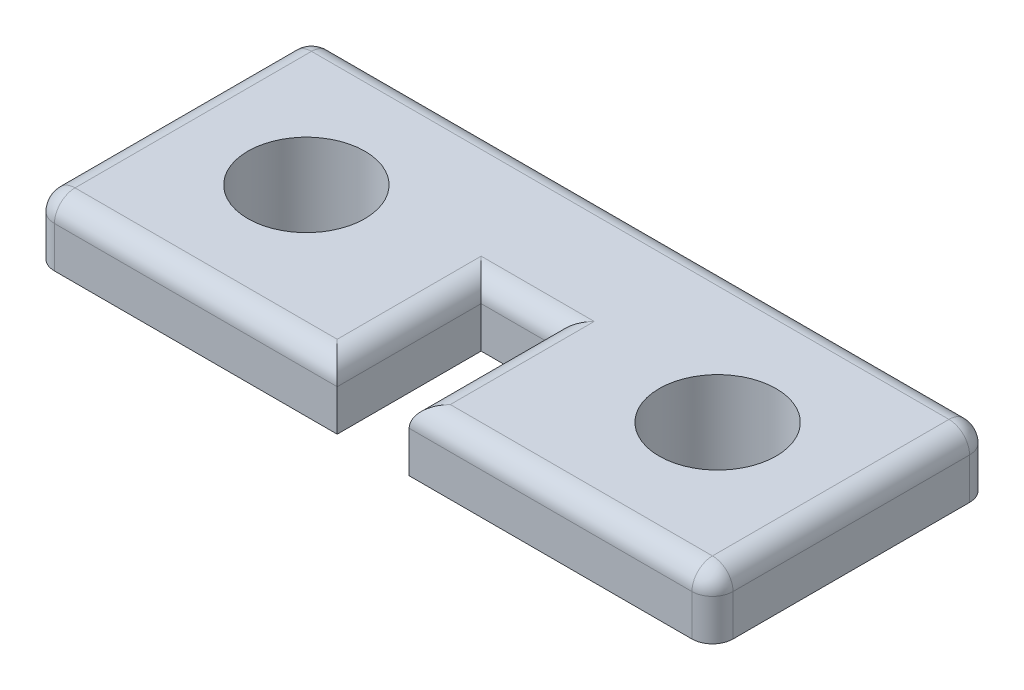
ISO-10303-21;
HEADER;
FILE_DESCRIPTION(('STEP AP214'),'2;1');
FILE_NAME('part.step','',(''),(''),'','','');
FILE_SCHEMA(('AUTOMOTIVE_DESIGN { 1 0 10303 214 1 1 1 1 }'));
ENDSEC;
DATA;
#1=APPLICATION_CONTEXT('core data for automotive mechanical design processes');
#2=APPLICATION_PROTOCOL_DEFINITION('international standard','automotive_design',2000,#1);
#3=PRODUCT_CONTEXT('',#1,'mechanical');
#4=PRODUCT('Part','Part','',(#3));
#5=PRODUCT_RELATED_PRODUCT_CATEGORY('part','',(#4));
#6=PRODUCT_DEFINITION_FORMATION('','',#4);
#7=PRODUCT_DEFINITION_CONTEXT('part definition',#1,'design');
#8=PRODUCT_DEFINITION('design','',#6,#7);
#9=PRODUCT_DEFINITION_SHAPE('','',#8);
#10=(LENGTH_UNIT() NAMED_UNIT(*) SI_UNIT(.MILLI.,.METRE.));
#11=(NAMED_UNIT(*) PLANE_ANGLE_UNIT() SI_UNIT($,.RADIAN.));
#12=(NAMED_UNIT(*) SI_UNIT($,.STERADIAN.) SOLID_ANGLE_UNIT());
#13=UNCERTAINTY_MEASURE_WITH_UNIT(LENGTH_MEASURE(1.E-05),#10,'distance_accuracy_value','');
#14=(GEOMETRIC_REPRESENTATION_CONTEXT(3) GLOBAL_UNCERTAINTY_ASSIGNED_CONTEXT((#13)) GLOBAL_UNIT_ASSIGNED_CONTEXT((#10,
#11,#12)) REPRESENTATION_CONTEXT('',''));
#15=CARTESIAN_POINT('',(0.,0.,0.));
#16=DIRECTION('',(0.,0.,1.));
#17=DIRECTION('',(1.,0.,0.));
#18=AXIS2_PLACEMENT_3D('',#15,#16,#17);
#19=CARTESIAN_POINT('',(0.,0.,0.));
#20=DIRECTION('',(0.,-1.,0.));
#21=DIRECTION('',(0.,0.,-1.));
#22=AXIS2_PLACEMENT_3D('',#19,#20,#21);
#23=PLANE('',#22);
#24=CARTESIAN_POINT('',(5.,0.,0.));
#25=DIRECTION('',(0.,-1.,0.));
#26=DIRECTION('',(0.,0.,-1.));
#27=AXIS2_PLACEMENT_3D('',#24,#25,#26);
#28=CIRCLE('',#27,2.0225);
#29=CARTESIAN_POINT('',(5.,0.,-2.0225));
#30=VERTEX_POINT('',#29);
#31=EDGE_CURVE('E313',#30,#30,#28,.T.);
#32=ORIENTED_EDGE('',*,*,#31,.F.);
#33=EDGE_LOOP('',(#32));
#34=FACE_BOUND('',#33,.T.);
#35=DIRECTION('',(0.,0.,-1.));
#36=VECTOR('',#35,1.);
#37=CARTESIAN_POINT('',(8.25,0.,3.375));
#38=LINE('',#37,#36);
#39=CARTESIAN_POINT('',(8.25,0.,2.875));
#40=VERTEX_POINT('',#39);
#41=CARTESIAN_POINT('',(8.25,0.,-2.875));
#42=VERTEX_POINT('',#41);
#43=EDGE_CURVE('E322',#40,#42,#38,.T.);
#44=ORIENTED_EDGE('',*,*,#43,.F.);
#45=CARTESIAN_POINT('',(7.75,0.,2.875));
#46=DIRECTION('',(0.,-1.,0.));
#47=DIRECTION('',(0.,0.,-1.));
#48=AXIS2_PLACEMENT_3D('',#45,#46,#47);
#49=CIRCLE('',#48,0.5);
#50=CARTESIAN_POINT('',(7.75,0.,3.375));
#51=VERTEX_POINT('',#50);
#52=EDGE_CURVE('E212',#40,#51,#49,.T.);
#53=ORIENTED_EDGE('',*,*,#52,.T.);
#54=DIRECTION('',(1.,0.,0.));
#55=VECTOR('',#54,1.);
#56=CARTESIAN_POINT('',(0.874999999999998,0.,3.375));
#57=LINE('',#56,#55);
#58=CARTESIAN_POINT('',(0.874999999999998,0.,3.375));
#59=VERTEX_POINT('',#58);
#60=EDGE_CURVE('E180',#59,#51,#57,.T.);
#61=ORIENTED_EDGE('',*,*,#60,.F.);
#62=DIRECTION('',(0.,0.,1.));
#63=VECTOR('',#62,1.);
#64=CARTESIAN_POINT('',(0.874999999999998,0.,-0.125));
#65=LINE('',#64,#63);
#66=CARTESIAN_POINT('',(0.874999999999998,0.,-0.125));
#67=VERTEX_POINT('',#66);
#68=EDGE_CURVE('E174',#67,#59,#65,.T.);
#69=ORIENTED_EDGE('',*,*,#68,.F.);
#70=DIRECTION('',(1.,0.,0.));
#71=VECTOR('',#70,1.);
#72=CARTESIAN_POINT('',(0.874999999999998,0.,-0.125));
#73=LINE('',#72,#71);
#74=CARTESIAN_POINT('',(-0.875000000000002,0.,-0.125));
#75=VERTEX_POINT('',#74);
#76=EDGE_CURVE('E172',#75,#67,#73,.T.);
#77=ORIENTED_EDGE('',*,*,#76,.F.);
#78=DIRECTION('',(0.,0.,-1.));
#79=VECTOR('',#78,1.);
#80=CARTESIAN_POINT('',(-0.875000000000002,0.,-0.125));
#81=LINE('',#80,#79);
#82=CARTESIAN_POINT('',(-0.875000000000002,0.,3.375));
#83=VERTEX_POINT('',#82);
#84=EDGE_CURVE('E151',#83,#75,#81,.T.);
#85=ORIENTED_EDGE('',*,*,#84,.F.);
#86=DIRECTION('',(1.,0.,0.));
#87=VECTOR('',#86,1.);
#88=CARTESIAN_POINT('',(-0.875000000000002,0.,3.375));
#89=LINE('',#88,#87);
#90=CARTESIAN_POINT('',(-7.75,0.,3.375));
#91=VERTEX_POINT('',#90);
#92=EDGE_CURVE('E160',#91,#83,#89,.T.);
#93=ORIENTED_EDGE('',*,*,#92,.F.);
#94=CARTESIAN_POINT('',(-7.75,0.,2.875));
#95=DIRECTION('',(0.,-1.,0.));
#96=DIRECTION('',(0.,0.,-1.));
#97=AXIS2_PLACEMENT_3D('',#94,#95,#96);
#98=CIRCLE('',#97,0.5);
#99=CARTESIAN_POINT('',(-8.25,0.,2.875));
#100=VERTEX_POINT('',#99);
#101=EDGE_CURVE('E208',#91,#100,#98,.T.);
#102=ORIENTED_EDGE('',*,*,#101,.T.);
#103=DIRECTION('',(0.,0.,1.));
#104=VECTOR('',#103,1.);
#105=CARTESIAN_POINT('',(-8.25,0.,3.375));
#106=LINE('',#105,#104);
#107=CARTESIAN_POINT('',(-8.25,0.,-2.875));
#108=VERTEX_POINT('',#107);
#109=EDGE_CURVE('E166',#108,#100,#106,.T.);
#110=ORIENTED_EDGE('',*,*,#109,.F.);
#111=CARTESIAN_POINT('',(-7.75,0.,-2.875));
#112=DIRECTION('',(0.,-1.,0.));
#113=DIRECTION('',(0.,0.,-1.));
#114=AXIS2_PLACEMENT_3D('',#111,#112,#113);
#115=CIRCLE('',#114,0.5);
#116=CARTESIAN_POINT('',(-7.75,0.,-3.375));
#117=VERTEX_POINT('',#116);
#118=EDGE_CURVE('E206',#108,#117,#115,.T.);
#119=ORIENTED_EDGE('',*,*,#118,.T.);
#120=DIRECTION('',(-1.,0.,0.));
#121=VECTOR('',#120,1.);
#122=CARTESIAN_POINT('',(-8.25,0.,-3.375));
#123=LINE('',#122,#121);
#124=CARTESIAN_POINT('',(7.75,0.,-3.375));
#125=VERTEX_POINT('',#124);
#126=EDGE_CURVE('E325',#125,#117,#123,.T.);
#127=ORIENTED_EDGE('',*,*,#126,.F.);
#128=CARTESIAN_POINT('',(7.75,0.,-2.875));
#129=DIRECTION('',(0.,-1.,0.));
#130=DIRECTION('',(0.,0.,-1.));
#131=AXIS2_PLACEMENT_3D('',#128,#129,#130);
#132=CIRCLE('',#131,0.5);
#133=EDGE_CURVE('E210',#125,#42,#132,.T.);
#134=ORIENTED_EDGE('',*,*,#133,.T.);
#135=EDGE_LOOP('',(#44,#53,#61,#69,#77,#85,#93,#102,#110,#119,#127,#134));
#136=FACE_BOUND('',#135,.T.);
#137=CARTESIAN_POINT('',(-5.,0.,0.));
#138=DIRECTION('',(0.,-1.,0.));
#139=DIRECTION('',(0.,0.,-1.));
#140=AXIS2_PLACEMENT_3D('',#137,#138,#139);
#141=CIRCLE('',#140,2.0225);
#142=CARTESIAN_POINT('',(-5.,0.,-2.0225));
#143=VERTEX_POINT('',#142);
#144=EDGE_CURVE('E303',#143,#143,#141,.T.);
#145=ORIENTED_EDGE('',*,*,#144,.F.);
#146=EDGE_LOOP('',(#145));
#147=FACE_BOUND('',#146,.T.);
#148=ADVANCED_FACE('F33',(#34,#136,#147),#23,.T.);
#149=CARTESIAN_POINT('',(0.,1.5,0.));
#150=DIRECTION('',(0.,-1.,0.));
#151=DIRECTION('',(0.,0.,-1.));
#152=AXIS2_PLACEMENT_3D('',#149,#150,#151);
#153=PLANE('',#152);
#154=DIRECTION('',(0.,0.,-1.));
#155=VECTOR('',#154,1.);
#156=CARTESIAN_POINT('',(7.75,1.5,0.));
#157=LINE('',#156,#155);
#158=CARTESIAN_POINT('',(7.75,1.5,2.875));
#159=VERTEX_POINT('',#158);
#160=CARTESIAN_POINT('',(7.75,1.5,-2.875));
#161=VERTEX_POINT('',#160);
#162=EDGE_CURVE('E245',#159,#161,#157,.T.);
#163=ORIENTED_EDGE('',*,*,#162,.T.);
#164=DIRECTION('',(-1.,0.,0.));
#165=VECTOR('',#164,1.);
#166=CARTESIAN_POINT('',(0.,1.5,-2.875));
#167=LINE('',#166,#165);
#168=CARTESIAN_POINT('',(-7.75,1.5,-2.875));
#169=VERTEX_POINT('',#168);
#170=EDGE_CURVE('E247',#161,#169,#167,.T.);
#171=ORIENTED_EDGE('',*,*,#170,.T.);
#172=DIRECTION('',(0.,0.,1.));
#173=VECTOR('',#172,1.);
#174=CARTESIAN_POINT('',(-7.75,1.5,0.));
#175=LINE('',#174,#173);
#176=CARTESIAN_POINT('',(-7.75,1.5,2.875));
#177=VERTEX_POINT('',#176);
#178=EDGE_CURVE('E233',#169,#177,#175,.T.);
#179=ORIENTED_EDGE('',*,*,#178,.T.);
#180=DIRECTION('',(1.,0.,0.));
#181=VECTOR('',#180,1.);
#182=CARTESIAN_POINT('',(0.,1.5,2.875));
#183=LINE('',#182,#181);
#184=CARTESIAN_POINT('',(-1.375,1.5,2.875));
#185=VERTEX_POINT('',#184);
#186=EDGE_CURVE('E235',#177,#185,#183,.T.);
#187=ORIENTED_EDGE('',*,*,#186,.T.);
#188=DIRECTION('',(0.,0.,-1.));
#189=VECTOR('',#188,1.);
#190=CARTESIAN_POINT('',(-1.375,1.5,0.));
#191=LINE('',#190,#189);
#192=CARTESIAN_POINT('',(-1.375,1.5,-0.625));
#193=VERTEX_POINT('',#192);
#194=EDGE_CURVE('E237',#185,#193,#191,.T.);
#195=ORIENTED_EDGE('',*,*,#194,.T.);
#196=DIRECTION('',(1.,0.,0.));
#197=VECTOR('',#196,1.);
#198=CARTESIAN_POINT('',(0.,1.5,-0.625));
#199=LINE('',#198,#197);
#200=CARTESIAN_POINT('',(1.375,1.5,-0.625000000000001));
#201=VERTEX_POINT('',#200);
#202=EDGE_CURVE('E239',#193,#201,#199,.T.);
#203=ORIENTED_EDGE('',*,*,#202,.T.);
#204=DIRECTION('',(0.,0.,1.));
#205=VECTOR('',#204,1.);
#206=CARTESIAN_POINT('',(1.375,1.5,0.));
#207=LINE('',#206,#205);
#208=CARTESIAN_POINT('',(1.375,1.5,2.875));
#209=VERTEX_POINT('',#208);
#210=EDGE_CURVE('E241',#201,#209,#207,.T.);
#211=ORIENTED_EDGE('',*,*,#210,.T.);
#212=DIRECTION('',(1.,0.,0.));
#213=VECTOR('',#212,1.);
#214=CARTESIAN_POINT('',(0.,1.5,2.875));
#215=LINE('',#214,#213);
#216=EDGE_CURVE('E243',#209,#159,#215,.T.);
#217=ORIENTED_EDGE('',*,*,#216,.T.);
#218=EDGE_LOOP('',(#163,#171,#179,#187,#195,#203,#211,#217));
#219=FACE_BOUND('',#218,.T.);
#220=CARTESIAN_POINT('',(-5.,1.5,0.));
#221=DIRECTION('',(0.,1.,0.));
#222=DIRECTION('',(0.,0.,1.));
#223=AXIS2_PLACEMENT_3D('',#220,#221,#222);
#224=CIRCLE('',#223,1.4225);
#225=CARTESIAN_POINT('',(-5.,1.5,1.4225));
#226=VERTEX_POINT('',#225);
#227=EDGE_CURVE('E319',#226,#226,#224,.T.);
#228=ORIENTED_EDGE('',*,*,#227,.F.);
#229=EDGE_LOOP('',(#228));
#230=FACE_BOUND('',#229,.T.);
#231=CARTESIAN_POINT('',(5.,1.5,0.));
#232=DIRECTION('',(0.,1.,0.));
#233=DIRECTION('',(0.,0.,1.));
#234=AXIS2_PLACEMENT_3D('',#231,#232,#233);
#235=CIRCLE('',#234,1.4225);
#236=CARTESIAN_POINT('',(5.,1.5,1.4225));
#237=VERTEX_POINT('',#236);
#238=EDGE_CURVE('E316',#237,#237,#235,.T.);
#239=ORIENTED_EDGE('',*,*,#238,.F.);
#240=EDGE_LOOP('',(#239));
#241=FACE_BOUND('',#240,.T.);
#242=ADVANCED_FACE('F401',(#219,#230,#241),#153,.F.);
#243=CARTESIAN_POINT('',(8.25,1.5,3.375));
#244=DIRECTION('',(-1.,0.,0.));
#245=DIRECTION('',(0.,0.,1.));
#246=AXIS2_PLACEMENT_3D('',#243,#244,#245);
#247=PLANE('',#246);
#248=DIRECTION('',(0.,0.,-1.));
#249=VECTOR('',#248,1.);
#250=CARTESIAN_POINT('',(8.25,1.,3.375));
#251=LINE('',#250,#249);
#252=CARTESIAN_POINT('',(8.25,1.,-2.875));
#253=VERTEX_POINT('',#252);
#254=CARTESIAN_POINT('',(8.25,1.,2.875));
#255=VERTEX_POINT('',#254);
#256=EDGE_CURVE('E199',#253,#255,#251,.F.);
#257=ORIENTED_EDGE('',*,*,#256,.T.);
#258=DIRECTION('',(0.,-1.,0.));
#259=VECTOR('',#258,1.);
#260=CARTESIAN_POINT('',(8.25,1.5,2.875));
#261=LINE('',#260,#259);
#262=EDGE_CURVE('E203',#255,#40,#261,.T.);
#263=ORIENTED_EDGE('',*,*,#262,.T.);
#264=ORIENTED_EDGE('',*,*,#43,.T.);
#265=DIRECTION('',(0.,-1.,0.));
#266=VECTOR('',#265,1.);
#267=CARTESIAN_POINT('',(8.25,1.5,-2.875));
#268=LINE('',#267,#266);
#269=EDGE_CURVE('E201',#42,#253,#268,.F.);
#270=ORIENTED_EDGE('',*,*,#269,.T.);
#271=EDGE_LOOP('',(#257,#263,#264,#270));
#272=FACE_BOUND('',#271,.T.);
#273=ADVANCED_FACE('F370',(#272),#247,.F.);
#274=CARTESIAN_POINT('',(-8.25,1.5,-3.375));
#275=DIRECTION('',(0.,0.,1.));
#276=DIRECTION('',(1.,0.,0.));
#277=AXIS2_PLACEMENT_3D('',#274,#275,#276);
#278=PLANE('',#277);
#279=DIRECTION('',(-1.,0.,0.));
#280=VECTOR('',#279,1.);
#281=CARTESIAN_POINT('',(-8.25,1.,-3.375));
#282=LINE('',#281,#280);
#283=CARTESIAN_POINT('',(-7.75,1.,-3.375));
#284=VERTEX_POINT('',#283);
#285=CARTESIAN_POINT('',(7.75,1.,-3.375));
#286=VERTEX_POINT('',#285);
#287=EDGE_CURVE('E218',#284,#286,#282,.F.);
#288=ORIENTED_EDGE('',*,*,#287,.T.);
#289=DIRECTION('',(0.,-1.,0.));
#290=VECTOR('',#289,1.);
#291=CARTESIAN_POINT('',(7.75,1.5,-3.375));
#292=LINE('',#291,#290);
#293=EDGE_CURVE('E222',#286,#125,#292,.T.);
#294=ORIENTED_EDGE('',*,*,#293,.T.);
#295=ORIENTED_EDGE('',*,*,#126,.T.);
#296=DIRECTION('',(0.,-1.,0.));
#297=VECTOR('',#296,1.);
#298=CARTESIAN_POINT('',(-7.75,1.5,-3.375));
#299=LINE('',#298,#297);
#300=EDGE_CURVE('E220',#117,#284,#299,.F.);
#301=ORIENTED_EDGE('',*,*,#300,.T.);
#302=EDGE_LOOP('',(#288,#294,#295,#301));
#303=FACE_BOUND('',#302,.T.);
#304=ADVANCED_FACE('F349',(#303),#278,.F.);
#305=CARTESIAN_POINT('',(-8.25,1.5,3.375));
#306=DIRECTION('',(1.,0.,0.));
#307=DIRECTION('',(0.,0.,-1.));
#308=AXIS2_PLACEMENT_3D('',#305,#306,#307);
#309=PLANE('',#308);
#310=ORIENTED_EDGE('',*,*,#109,.T.);
#311=DIRECTION('',(0.,-1.,0.));
#312=VECTOR('',#311,1.);
#313=CARTESIAN_POINT('',(-8.25,1.5,2.875));
#314=LINE('',#313,#312);
#315=CARTESIAN_POINT('',(-8.25,1.,2.875));
#316=VERTEX_POINT('',#315);
#317=EDGE_CURVE('E231',#100,#316,#314,.F.);
#318=ORIENTED_EDGE('',*,*,#317,.T.);
#319=DIRECTION('',(0.,0.,1.));
#320=VECTOR('',#319,1.);
#321=CARTESIAN_POINT('',(-8.25,1.,3.375));
#322=LINE('',#321,#320);
#323=CARTESIAN_POINT('',(-8.25,1.,-2.875));
#324=VERTEX_POINT('',#323);
#325=EDGE_CURVE('E227',#316,#324,#322,.F.);
#326=ORIENTED_EDGE('',*,*,#325,.T.);
#327=DIRECTION('',(0.,-1.,0.));
#328=VECTOR('',#327,1.);
#329=CARTESIAN_POINT('',(-8.25,1.5,-2.875));
#330=LINE('',#329,#328);
#331=EDGE_CURVE('E229',#324,#108,#330,.T.);
#332=ORIENTED_EDGE('',*,*,#331,.T.);
#333=EDGE_LOOP('',(#310,#318,#326,#332));
#334=FACE_BOUND('',#333,.T.);
#335=ADVANCED_FACE('F331',(#334),#309,.F.);
#336=CARTESIAN_POINT('',(-0.875000000000002,1.5,3.375));
#337=DIRECTION('',(0.,0.,-1.));
#338=DIRECTION('',(-1.,0.,0.));
#339=AXIS2_PLACEMENT_3D('',#336,#337,#338);
#340=PLANE('',#339);
#341=DIRECTION('',(1.,0.,0.));
#342=VECTOR('',#341,1.);
#343=CARTESIAN_POINT('',(-0.875000000000002,1.,3.375));
#344=LINE('',#343,#342);
#345=CARTESIAN_POINT('',(-0.875000000000002,1.,3.375));
#346=VERTEX_POINT('',#345);
#347=CARTESIAN_POINT('',(-7.75,1.,3.375));
#348=VERTEX_POINT('',#347);
#349=EDGE_CURVE('E224',#346,#348,#344,.F.);
#350=ORIENTED_EDGE('',*,*,#349,.T.);
#351=DIRECTION('',(0.,-1.,0.));
#352=VECTOR('',#351,1.);
#353=CARTESIAN_POINT('',(-7.75,1.5,3.375));
#354=LINE('',#353,#352);
#355=EDGE_CURVE('E163',#348,#91,#354,.T.);
#356=ORIENTED_EDGE('',*,*,#355,.T.);
#357=ORIENTED_EDGE('',*,*,#92,.T.);
#358=DIRECTION('',(0.,-1.,0.));
#359=VECTOR('',#358,1.);
#360=CARTESIAN_POINT('',(-0.875000000000002,1.5,3.375));
#361=LINE('',#360,#359);
#362=EDGE_CURVE('E147',#346,#83,#361,.T.);
#363=ORIENTED_EDGE('',*,*,#362,.F.);
#364=EDGE_LOOP('',(#350,#356,#357,#363));
#365=FACE_BOUND('',#364,.T.);
#366=ADVANCED_FACE('F161',(#365),#340,.F.);
#367=CARTESIAN_POINT('',(-0.875000000000002,1.5,-0.125));
#368=DIRECTION('',(-1.,0.,0.));
#369=DIRECTION('',(0.,0.,1.));
#370=AXIS2_PLACEMENT_3D('',#367,#368,#369);
#371=PLANE('',#370);
#372=DIRECTION('',(0.,-1.,0.));
#373=VECTOR('',#372,1.);
#374=CARTESIAN_POINT('',(-0.875000000000002,1.5,-0.125));
#375=LINE('',#374,#373);
#376=CARTESIAN_POINT('',(-0.875000000000002,1.,-0.125));
#377=VERTEX_POINT('',#376);
#378=EDGE_CURVE('E157',#377,#75,#375,.T.);
#379=ORIENTED_EDGE('',*,*,#378,.F.);
#380=DIRECTION('',(0.,0.,-1.));
#381=VECTOR('',#380,1.);
#382=CARTESIAN_POINT('',(-0.875000000000002,1.,-0.125));
#383=LINE('',#382,#381);
#384=EDGE_CURVE('E11',#377,#346,#383,.F.);
#385=ORIENTED_EDGE('',*,*,#384,.T.);
#386=ORIENTED_EDGE('',*,*,#362,.T.);
#387=ORIENTED_EDGE('',*,*,#84,.T.);
#388=EDGE_LOOP('',(#379,#385,#386,#387));
#389=FACE_BOUND('',#388,.T.);
#390=ADVANCED_FACE('F149',(#389),#371,.F.);
#391=CARTESIAN_POINT('',(0.874999999999998,1.5,-0.125));
#392=DIRECTION('',(0.,0.,-1.));
#393=DIRECTION('',(-1.,0.,0.));
#394=AXIS2_PLACEMENT_3D('',#391,#392,#393);
#395=PLANE('',#394);
#396=DIRECTION('',(0.,-1.,0.));
#397=VECTOR('',#396,1.);
#398=CARTESIAN_POINT('',(0.874999999999998,1.5,-0.125));
#399=LINE('',#398,#397);
#400=CARTESIAN_POINT('',(0.874999999999998,1.,-0.125));
#401=VERTEX_POINT('',#400);
#402=EDGE_CURVE('E185',#401,#67,#399,.T.);
#403=ORIENTED_EDGE('',*,*,#402,.F.);
#404=DIRECTION('',(1.,0.,0.));
#405=VECTOR('',#404,1.);
#406=CARTESIAN_POINT('',(0.874999999999998,1.,-0.125));
#407=LINE('',#406,#405);
#408=EDGE_CURVE('E42',#401,#377,#407,.F.);
#409=ORIENTED_EDGE('',*,*,#408,.T.);
#410=ORIENTED_EDGE('',*,*,#378,.T.);
#411=ORIENTED_EDGE('',*,*,#76,.T.);
#412=EDGE_LOOP('',(#403,#409,#410,#411));
#413=FACE_BOUND('',#412,.T.);
#414=ADVANCED_FACE('F440',(#413),#395,.F.);
#415=CARTESIAN_POINT('',(0.874999999999998,1.5,-0.125));
#416=DIRECTION('',(1.,0.,0.));
#417=DIRECTION('',(0.,0.,-1.));
#418=AXIS2_PLACEMENT_3D('',#415,#416,#417);
#419=PLANE('',#418);
#420=DIRECTION('',(0.,-1.,0.));
#421=VECTOR('',#420,1.);
#422=CARTESIAN_POINT('',(0.874999999999998,1.5,3.375));
#423=LINE('',#422,#421);
#424=CARTESIAN_POINT('',(0.874999999999998,1.,3.375));
#425=VERTEX_POINT('',#424);
#426=EDGE_CURVE('E183',#425,#59,#423,.T.);
#427=ORIENTED_EDGE('',*,*,#426,.F.);
#428=DIRECTION('',(0.,0.,1.));
#429=VECTOR('',#428,1.);
#430=CARTESIAN_POINT('',(0.874999999999998,1.,-0.125));
#431=LINE('',#430,#429);
#432=EDGE_CURVE('E57',#425,#401,#431,.F.);
#433=ORIENTED_EDGE('',*,*,#432,.T.);
#434=ORIENTED_EDGE('',*,*,#402,.T.);
#435=ORIENTED_EDGE('',*,*,#68,.T.);
#436=EDGE_LOOP('',(#427,#433,#434,#435));
#437=FACE_BOUND('',#436,.T.);
#438=ADVANCED_FACE('F386',(#437),#419,.F.);
#439=CARTESIAN_POINT('',(0.874999999999998,1.5,3.375));
#440=DIRECTION('',(0.,0.,-1.));
#441=DIRECTION('',(-1.,0.,0.));
#442=AXIS2_PLACEMENT_3D('',#439,#440,#441);
#443=PLANE('',#442);
#444=ORIENTED_EDGE('',*,*,#60,.T.);
#445=DIRECTION('',(0.,-1.,0.));
#446=VECTOR('',#445,1.);
#447=CARTESIAN_POINT('',(7.75,1.5,3.375));
#448=LINE('',#447,#446);
#449=CARTESIAN_POINT('',(7.75,1.,3.375));
#450=VERTEX_POINT('',#449);
#451=EDGE_CURVE('E216',#51,#450,#448,.F.);
#452=ORIENTED_EDGE('',*,*,#451,.T.);
#453=DIRECTION('',(1.,0.,0.));
#454=VECTOR('',#453,1.);
#455=CARTESIAN_POINT('',(0.874999999999998,1.,3.375));
#456=LINE('',#455,#454);
#457=EDGE_CURVE('E214',#450,#425,#456,.F.);
#458=ORIENTED_EDGE('',*,*,#457,.T.);
#459=ORIENTED_EDGE('',*,*,#426,.T.);
#460=EDGE_LOOP('',(#444,#452,#458,#459));
#461=FACE_BOUND('',#460,.T.);
#462=ADVANCED_FACE('F376',(#461),#443,.F.);
#463=CARTESIAN_POINT('',(-5.,1.5,0.));
#464=DIRECTION('',(0.,-1.,0.));
#465=DIRECTION('',(0.,0.,-1.));
#466=AXIS2_PLACEMENT_3D('',#463,#464,#465);
#467=CYLINDRICAL_SURFACE('',#466,1.4225);
#468=ORIENTED_EDGE('',*,*,#227,.T.);
#469=EDGE_LOOP('',(#468));
#470=FACE_BOUND('',#469,.T.);
#471=CARTESIAN_POINT('',(-5.,-1.5,0.));
#472=DIRECTION('',(0.,-1.,0.));
#473=DIRECTION('',(0.,0.,-1.));
#474=AXIS2_PLACEMENT_3D('',#471,#472,#473);
#475=CIRCLE('',#474,1.4225);
#476=CARTESIAN_POINT('',(-5.,-1.5,-1.4225));
#477=VERTEX_POINT('',#476);
#478=EDGE_CURVE('E298',#477,#477,#475,.T.);
#479=ORIENTED_EDGE('',*,*,#478,.T.);
#480=EDGE_LOOP('',(#479));
#481=FACE_BOUND('',#480,.T.);
#482=ADVANCED_FACE('F413',(#470,#481),#467,.F.);
#483=CARTESIAN_POINT('',(5.,1.5,0.));
#484=DIRECTION('',(0.,-1.,0.));
#485=DIRECTION('',(0.,0.,-1.));
#486=AXIS2_PLACEMENT_3D('',#483,#484,#485);
#487=CYLINDRICAL_SURFACE('',#486,1.4225);
#488=ORIENTED_EDGE('',*,*,#238,.T.);
#489=EDGE_LOOP('',(#488));
#490=FACE_BOUND('',#489,.T.);
#491=CARTESIAN_POINT('',(5.,-1.5,0.));
#492=DIRECTION('',(0.,-1.,0.));
#493=DIRECTION('',(0.,0.,-1.));
#494=AXIS2_PLACEMENT_3D('',#491,#492,#493);
#495=CIRCLE('',#494,1.4225);
#496=CARTESIAN_POINT('',(5.,-1.5,-1.4225));
#497=VERTEX_POINT('',#496);
#498=EDGE_CURVE('E308',#497,#497,#495,.T.);
#499=ORIENTED_EDGE('',*,*,#498,.T.);
#500=EDGE_LOOP('',(#499));
#501=FACE_BOUND('',#500,.T.);
#502=ADVANCED_FACE('F409',(#490,#501),#487,.F.);
#503=CARTESIAN_POINT('',(5.,-1.5,0.));
#504=DIRECTION('',(0.,-1.,0.));
#505=DIRECTION('',(0.,0.,-1.));
#506=AXIS2_PLACEMENT_3D('',#503,#504,#505);
#507=PLANE('',#506);
#508=CARTESIAN_POINT('',(5.,-1.5,0.));
#509=DIRECTION('',(0.,-1.,0.));
#510=DIRECTION('',(0.,0.,-1.));
#511=AXIS2_PLACEMENT_3D('',#508,#509,#510);
#512=CIRCLE('',#511,1.5225);
#513=CARTESIAN_POINT('',(5.,-1.5,-1.5225));
#514=VERTEX_POINT('',#513);
#515=EDGE_CURVE('E193',#514,#514,#512,.T.);
#516=ORIENTED_EDGE('',*,*,#515,.T.);
#517=EDGE_LOOP('',(#516));
#518=FACE_BOUND('',#517,.T.);
#519=ORIENTED_EDGE('',*,*,#498,.F.);
#520=EDGE_LOOP('',(#519));
#521=FACE_BOUND('',#520,.T.);
#522=ADVANCED_FACE('F412',(#518,#521),#507,.T.);
#523=CARTESIAN_POINT('',(5.,-1.5,0.));
#524=DIRECTION('',(0.,1.,0.));
#525=DIRECTION('',(0.,0.,1.));
#526=AXIS2_PLACEMENT_3D('',#523,#524,#525);
#527=CYLINDRICAL_SURFACE('',#526,2.0225);
#528=CARTESIAN_POINT('',(5.,-1.,0.));
#529=DIRECTION('',(0.,-1.,0.));
#530=DIRECTION('',(0.,0.,-1.));
#531=AXIS2_PLACEMENT_3D('',#528,#529,#530);
#532=CIRCLE('',#531,2.0225);
#533=CARTESIAN_POINT('',(5.,-1.,-2.0225));
#534=VERTEX_POINT('',#533);
#535=EDGE_CURVE('E196',#534,#534,#532,.F.);
#536=ORIENTED_EDGE('',*,*,#535,.T.);
#537=EDGE_LOOP('',(#536));
#538=FACE_BOUND('',#537,.T.);
#539=ORIENTED_EDGE('',*,*,#31,.T.);
#540=EDGE_LOOP('',(#539));
#541=FACE_BOUND('',#540,.T.);
#542=ADVANCED_FACE('F418',(#538,#541),#527,.T.);
#543=CARTESIAN_POINT('',(-5.,-1.5,0.));
#544=DIRECTION('',(0.,-1.,0.));
#545=DIRECTION('',(0.,0.,-1.));
#546=AXIS2_PLACEMENT_3D('',#543,#544,#545);
#547=PLANE('',#546);
#548=CARTESIAN_POINT('',(-5.,-1.5,0.));
#549=DIRECTION('',(0.,-1.,0.));
#550=DIRECTION('',(0.,0.,-1.));
#551=AXIS2_PLACEMENT_3D('',#548,#549,#550);
#552=CIRCLE('',#551,1.5225);
#553=CARTESIAN_POINT('',(-5.,-1.5,-1.5225));
#554=VERTEX_POINT('',#553);
#555=EDGE_CURVE('E156',#554,#554,#552,.T.);
#556=ORIENTED_EDGE('',*,*,#555,.T.);
#557=EDGE_LOOP('',(#556));
#558=FACE_BOUND('',#557,.T.);
#559=ORIENTED_EDGE('',*,*,#478,.F.);
#560=EDGE_LOOP('',(#559));
#561=FACE_BOUND('',#560,.T.);
#562=ADVANCED_FACE('F424',(#558,#561),#547,.T.);
#563=CARTESIAN_POINT('',(-5.,-1.5,0.));
#564=DIRECTION('',(0.,1.,0.));
#565=DIRECTION('',(0.,0.,1.));
#566=AXIS2_PLACEMENT_3D('',#563,#564,#565);
#567=CYLINDRICAL_SURFACE('',#566,2.0225);
#568=CARTESIAN_POINT('',(-5.,-1.,0.));
#569=DIRECTION('',(0.,-1.,0.));
#570=DIRECTION('',(0.,0.,-1.));
#571=AXIS2_PLACEMENT_3D('',#568,#569,#570);
#572=CIRCLE('',#571,2.0225);
#573=CARTESIAN_POINT('',(-5.,-1.,-2.0225));
#574=VERTEX_POINT('',#573);
#575=EDGE_CURVE('E190',#574,#574,#572,.F.);
#576=ORIENTED_EDGE('',*,*,#575,.T.);
#577=EDGE_LOOP('',(#576));
#578=FACE_BOUND('',#577,.T.);
#579=ORIENTED_EDGE('',*,*,#144,.T.);
#580=EDGE_LOOP('',(#579));
#581=FACE_BOUND('',#580,.T.);
#582=ADVANCED_FACE('F457',(#578,#581),#567,.T.);
#583=CARTESIAN_POINT('',(-5.,-1.,0.));
#584=DIRECTION('',(0.,-1.,0.));
#585=DIRECTION('',(0.,0.,-1.));
#586=AXIS2_PLACEMENT_3D('',#583,#584,#585);
#587=TOROIDAL_SURFACE('',#586,1.5225,0.5);
#588=ORIENTED_EDGE('',*,*,#575,.F.);
#589=EDGE_LOOP('',(#588));
#590=FACE_BOUND('',#589,.T.);
#591=ORIENTED_EDGE('',*,*,#555,.F.);
#592=EDGE_LOOP('',(#591));
#593=FACE_BOUND('',#592,.T.);
#594=ADVANCED_FACE('F453',(#590,#593),#587,.T.);
#595=CARTESIAN_POINT('',(5.,-1.,0.));
#596=DIRECTION('',(0.,-1.,0.));
#597=DIRECTION('',(0.,0.,-1.));
#598=AXIS2_PLACEMENT_3D('',#595,#596,#597);
#599=TOROIDAL_SURFACE('',#598,1.5225,0.5);
#600=ORIENTED_EDGE('',*,*,#535,.F.);
#601=EDGE_LOOP('',(#600));
#602=FACE_BOUND('',#601,.T.);
#603=ORIENTED_EDGE('',*,*,#515,.F.);
#604=EDGE_LOOP('',(#603));
#605=FACE_BOUND('',#604,.T.);
#606=ADVANCED_FACE('F456',(#602,#605),#599,.T.);
#607=CARTESIAN_POINT('',(-7.75,1.5,2.875));
#608=DIRECTION('',(0.,-1.,0.));
#609=DIRECTION('',(0.,0.,-1.));
#610=AXIS2_PLACEMENT_3D('',#607,#608,#609);
#611=CYLINDRICAL_SURFACE('',#610,0.5);
#612=CARTESIAN_POINT('',(-7.75,1.,2.875));
#613=DIRECTION('',(0.,1.,0.));
#614=DIRECTION('',(0.,0.,1.));
#615=AXIS2_PLACEMENT_3D('',#612,#613,#614);
#616=CIRCLE('',#615,0.5);
#617=EDGE_CURVE('E37',#316,#348,#616,.T.);
#618=ORIENTED_EDGE('',*,*,#617,.F.);
#619=ORIENTED_EDGE('',*,*,#317,.F.);
#620=ORIENTED_EDGE('',*,*,#101,.F.);
#621=ORIENTED_EDGE('',*,*,#355,.F.);
#622=EDGE_LOOP('',(#618,#619,#620,#621));
#623=FACE_BOUND('',#622,.T.);
#624=ADVANCED_FACE('F35',(#623),#611,.T.);
#625=CARTESIAN_POINT('',(-7.75,1.,2.875));
#626=DIRECTION('',(0.,0.,1.));
#627=DIRECTION('',(1.,0.,0.));
#628=AXIS2_PLACEMENT_3D('',#625,#626,#627);
#629=SPHERICAL_SURFACE('',#628,0.5);
#630=CARTESIAN_POINT('',(-7.75,1.,2.875));
#631=DIRECTION('',(0.,0.,1.));
#632=DIRECTION('',(1.,0.,0.));
#633=AXIS2_PLACEMENT_3D('',#630,#631,#632);
#634=CIRCLE('',#633,0.5);
#635=EDGE_CURVE('E290',#316,#177,#634,.F.);
#636=ORIENTED_EDGE('',*,*,#635,.F.);
#637=ORIENTED_EDGE('',*,*,#617,.T.);
#638=CARTESIAN_POINT('',(-7.75,1.,2.875));
#639=DIRECTION('',(-1.,0.,0.));
#640=DIRECTION('',(0.,0.,1.));
#641=AXIS2_PLACEMENT_3D('',#638,#639,#640);
#642=CIRCLE('',#641,0.5);
#643=EDGE_CURVE('E292',#177,#348,#642,.F.);
#644=ORIENTED_EDGE('',*,*,#643,.F.);
#645=EDGE_LOOP('',(#636,#637,#644));
#646=FACE_BOUND('',#645,.T.);
#647=ADVANCED_FACE('F336',(#646),#629,.T.);
#648=CARTESIAN_POINT('',(0.,1.,2.875));
#649=DIRECTION('',(1.,0.,0.));
#650=DIRECTION('',(0.,0.,-1.));
#651=AXIS2_PLACEMENT_3D('',#648,#649,#650);
#652=CYLINDRICAL_SURFACE('',#651,0.5);
#653=ORIENTED_EDGE('',*,*,#643,.T.);
#654=ORIENTED_EDGE('',*,*,#349,.F.);
#655=CARTESIAN_POINT('',(-1.375,1.,2.875));
#656=DIRECTION('',(0.707106781186547,0.,-0.707106781186547));
#657=DIRECTION('',(0.707106781186547,0.,0.707106781186547));
#658=AXIS2_PLACEMENT_3D('',#655,#656,#657);
#659=ELLIPSE('',#658,0.707106781186548,0.5);
#660=EDGE_CURVE('E287',#185,#346,#659,.T.);
#661=ORIENTED_EDGE('',*,*,#660,.F.);
#662=ORIENTED_EDGE('',*,*,#186,.F.);
#663=EDGE_LOOP('',(#653,#654,#661,#662));
#664=FACE_BOUND('',#663,.T.);
#665=ADVANCED_FACE('F399',(#664),#652,.T.);
#666=CARTESIAN_POINT('',(-7.75,1.,0.));
#667=DIRECTION('',(0.,0.,1.));
#668=DIRECTION('',(1.,0.,0.));
#669=AXIS2_PLACEMENT_3D('',#666,#667,#668);
#670=CYLINDRICAL_SURFACE('',#669,0.5);
#671=ORIENTED_EDGE('',*,*,#635,.T.);
#672=ORIENTED_EDGE('',*,*,#178,.F.);
#673=CARTESIAN_POINT('',(-7.75,1.,-2.875));
#674=DIRECTION('',(0.,0.,-1.));
#675=DIRECTION('',(-1.,0.,0.));
#676=AXIS2_PLACEMENT_3D('',#673,#674,#675);
#677=CIRCLE('',#676,0.5);
#678=EDGE_CURVE('E284',#324,#169,#677,.T.);
#679=ORIENTED_EDGE('',*,*,#678,.F.);
#680=ORIENTED_EDGE('',*,*,#325,.F.);
#681=EDGE_LOOP('',(#671,#672,#679,#680));
#682=FACE_BOUND('',#681,.T.);
#683=ADVANCED_FACE('F340',(#682),#670,.T.);
#684=CARTESIAN_POINT('',(-7.75,1.5,-2.875));
#685=DIRECTION('',(0.,-1.,0.));
#686=DIRECTION('',(0.,0.,-1.));
#687=AXIS2_PLACEMENT_3D('',#684,#685,#686);
#688=CYLINDRICAL_SURFACE('',#687,0.5);
#689=ORIENTED_EDGE('',*,*,#118,.F.);
#690=ORIENTED_EDGE('',*,*,#331,.F.);
#691=CARTESIAN_POINT('',(-7.75,1.,-2.875));
#692=DIRECTION('',(0.,1.,0.));
#693=DIRECTION('',(0.,0.,1.));
#694=AXIS2_PLACEMENT_3D('',#691,#692,#693);
#695=CIRCLE('',#694,0.5);
#696=EDGE_CURVE('E281',#284,#324,#695,.T.);
#697=ORIENTED_EDGE('',*,*,#696,.F.);
#698=ORIENTED_EDGE('',*,*,#300,.F.);
#699=EDGE_LOOP('',(#689,#690,#697,#698));
#700=FACE_BOUND('',#699,.T.);
#701=ADVANCED_FACE('F343',(#700),#688,.T.);
#702=CARTESIAN_POINT('',(-1.375,1.,0.));
#703=DIRECTION('',(0.,0.,-1.));
#704=DIRECTION('',(-1.,0.,0.));
#705=AXIS2_PLACEMENT_3D('',#702,#703,#704);
#706=CYLINDRICAL_SURFACE('',#705,0.5);
#707=ORIENTED_EDGE('',*,*,#660,.T.);
#708=ORIENTED_EDGE('',*,*,#384,.F.);
#709=CARTESIAN_POINT('',(-1.375,1.,-0.625));
#710=DIRECTION('',(0.707106781186547,0.,-0.707106781186548));
#711=DIRECTION('',(0.707106781186548,0.,0.707106781186547));
#712=AXIS2_PLACEMENT_3D('',#709,#710,#711);
#713=ELLIPSE('',#712,0.707106781186547,0.5);
#714=EDGE_CURVE('E278',#193,#377,#713,.T.);
#715=ORIENTED_EDGE('',*,*,#714,.F.);
#716=ORIENTED_EDGE('',*,*,#194,.F.);
#717=EDGE_LOOP('',(#707,#708,#715,#716));
#718=FACE_BOUND('',#717,.T.);
#719=ADVANCED_FACE('F397',(#718),#706,.T.);
#720=CARTESIAN_POINT('',(-7.75,1.,-2.875));
#721=DIRECTION('',(0.,0.,1.));
#722=DIRECTION('',(1.,0.,0.));
#723=AXIS2_PLACEMENT_3D('',#720,#721,#722);
#724=SPHERICAL_SURFACE('',#723,0.5);
#725=ORIENTED_EDGE('',*,*,#696,.T.);
#726=ORIENTED_EDGE('',*,*,#678,.T.);
#727=CARTESIAN_POINT('',(-7.75,1.,-2.875));
#728=DIRECTION('',(-1.,0.,0.));
#729=DIRECTION('',(0.,0.,1.));
#730=AXIS2_PLACEMENT_3D('',#727,#728,#729);
#731=CIRCLE('',#730,0.5);
#732=EDGE_CURVE('E276',#284,#169,#731,.F.);
#733=ORIENTED_EDGE('',*,*,#732,.F.);
#734=EDGE_LOOP('',(#725,#726,#733));
#735=FACE_BOUND('',#734,.T.);
#736=ADVANCED_FACE('F480',(#735),#724,.T.);
#737=CARTESIAN_POINT('',(0.,1.,-0.625));
#738=DIRECTION('',(1.,0.,0.));
#739=DIRECTION('',(0.,0.,-1.));
#740=AXIS2_PLACEMENT_3D('',#737,#738,#739);
#741=CYLINDRICAL_SURFACE('',#740,0.5);
#742=ORIENTED_EDGE('',*,*,#714,.T.);
#743=ORIENTED_EDGE('',*,*,#408,.F.);
#744=CARTESIAN_POINT('',(1.375,1.,-0.625000000000001));
#745=DIRECTION('',(0.707106781186548,0.,0.707106781186547));
#746=DIRECTION('',(-0.707106781186547,0.,0.707106781186548));
#747=AXIS2_PLACEMENT_3D('',#744,#745,#746);
#748=ELLIPSE('',#747,0.707106781186547,0.5);
#749=EDGE_CURVE('E273',#201,#401,#748,.T.);
#750=ORIENTED_EDGE('',*,*,#749,.F.);
#751=ORIENTED_EDGE('',*,*,#202,.F.);
#752=EDGE_LOOP('',(#742,#743,#750,#751));
#753=FACE_BOUND('',#752,.T.);
#754=ADVANCED_FACE('F393',(#753),#741,.T.);
#755=CARTESIAN_POINT('',(0.,1.,-2.875));
#756=DIRECTION('',(-1.,0.,0.));
#757=DIRECTION('',(0.,0.,1.));
#758=AXIS2_PLACEMENT_3D('',#755,#756,#757);
#759=CYLINDRICAL_SURFACE('',#758,0.5);
#760=ORIENTED_EDGE('',*,*,#732,.T.);
#761=ORIENTED_EDGE('',*,*,#170,.F.);
#762=CARTESIAN_POINT('',(7.75,1.,-2.875));
#763=DIRECTION('',(1.,0.,0.));
#764=DIRECTION('',(0.,0.,-1.));
#765=AXIS2_PLACEMENT_3D('',#762,#763,#764);
#766=CIRCLE('',#765,0.5);
#767=EDGE_CURVE('E270',#286,#161,#766,.T.);
#768=ORIENTED_EDGE('',*,*,#767,.F.);
#769=ORIENTED_EDGE('',*,*,#287,.F.);
#770=EDGE_LOOP('',(#760,#761,#768,#769));
#771=FACE_BOUND('',#770,.T.);
#772=ADVANCED_FACE('F360',(#771),#759,.T.);
#773=CARTESIAN_POINT('',(7.75,1.5,-2.875));
#774=DIRECTION('',(0.,-1.,0.));
#775=DIRECTION('',(0.,0.,-1.));
#776=AXIS2_PLACEMENT_3D('',#773,#774,#775);
#777=CYLINDRICAL_SURFACE('',#776,0.5);
#778=ORIENTED_EDGE('',*,*,#133,.F.);
#779=ORIENTED_EDGE('',*,*,#293,.F.);
#780=CARTESIAN_POINT('',(7.75,1.,-2.875));
#781=DIRECTION('',(0.,1.,0.));
#782=DIRECTION('',(0.,0.,1.));
#783=AXIS2_PLACEMENT_3D('',#780,#781,#782);
#784=CIRCLE('',#783,0.5);
#785=EDGE_CURVE('E267',#253,#286,#784,.T.);
#786=ORIENTED_EDGE('',*,*,#785,.F.);
#787=ORIENTED_EDGE('',*,*,#269,.F.);
#788=EDGE_LOOP('',(#778,#779,#786,#787));
#789=FACE_BOUND('',#788,.T.);
#790=ADVANCED_FACE('F355',(#789),#777,.T.);
#791=CARTESIAN_POINT('',(1.375,1.,0.));
#792=DIRECTION('',(0.,0.,1.));
#793=DIRECTION('',(1.,0.,0.));
#794=AXIS2_PLACEMENT_3D('',#791,#792,#793);
#795=CYLINDRICAL_SURFACE('',#794,0.5);
#796=ORIENTED_EDGE('',*,*,#749,.T.);
#797=ORIENTED_EDGE('',*,*,#432,.F.);
#798=CARTESIAN_POINT('',(1.375,1.,2.875));
#799=DIRECTION('',(0.707106781186548,0.,0.707106781186547));
#800=DIRECTION('',(-0.707106781186547,0.,0.707106781186548));
#801=AXIS2_PLACEMENT_3D('',#798,#799,#800);
#802=ELLIPSE('',#801,0.707106781186547,0.5);
#803=EDGE_CURVE('E264',#209,#425,#802,.T.);
#804=ORIENTED_EDGE('',*,*,#803,.F.);
#805=ORIENTED_EDGE('',*,*,#210,.F.);
#806=EDGE_LOOP('',(#796,#797,#804,#805));
#807=FACE_BOUND('',#806,.T.);
#808=ADVANCED_FACE('F388',(#807),#795,.T.);
#809=CARTESIAN_POINT('',(7.75,1.,-2.875));
#810=DIRECTION('',(0.,0.,1.));
#811=DIRECTION('',(1.,0.,0.));
#812=AXIS2_PLACEMENT_3D('',#809,#810,#811);
#813=SPHERICAL_SURFACE('',#812,0.5);
#814=ORIENTED_EDGE('',*,*,#785,.T.);
#815=ORIENTED_EDGE('',*,*,#767,.T.);
#816=CARTESIAN_POINT('',(7.75,1.,-2.875));
#817=DIRECTION('',(0.,0.,-1.));
#818=DIRECTION('',(-1.,0.,0.));
#819=AXIS2_PLACEMENT_3D('',#816,#817,#818);
#820=CIRCLE('',#819,0.5);
#821=EDGE_CURVE('E261',#253,#161,#820,.F.);
#822=ORIENTED_EDGE('',*,*,#821,.F.);
#823=EDGE_LOOP('',(#814,#815,#822));
#824=FACE_BOUND('',#823,.T.);
#825=ADVANCED_FACE('F362',(#824),#813,.T.);
#826=CARTESIAN_POINT('',(0.,1.,2.875));
#827=DIRECTION('',(1.,0.,0.));
#828=DIRECTION('',(0.,0.,-1.));
#829=AXIS2_PLACEMENT_3D('',#826,#827,#828);
#830=CYLINDRICAL_SURFACE('',#829,0.5);
#831=ORIENTED_EDGE('',*,*,#803,.T.);
#832=ORIENTED_EDGE('',*,*,#457,.F.);
#833=CARTESIAN_POINT('',(7.75,1.,2.875));
#834=DIRECTION('',(1.,0.,0.));
#835=DIRECTION('',(0.,0.,-1.));
#836=AXIS2_PLACEMENT_3D('',#833,#834,#835);
#837=CIRCLE('',#836,0.5);
#838=EDGE_CURVE('E258',#159,#450,#837,.T.);
#839=ORIENTED_EDGE('',*,*,#838,.F.);
#840=ORIENTED_EDGE('',*,*,#216,.F.);
#841=EDGE_LOOP('',(#831,#832,#839,#840));
#842=FACE_BOUND('',#841,.T.);
#843=ADVANCED_FACE('F384',(#842),#830,.T.);
#844=CARTESIAN_POINT('',(7.75,1.,0.));
#845=DIRECTION('',(0.,0.,-1.));
#846=DIRECTION('',(-1.,0.,0.));
#847=AXIS2_PLACEMENT_3D('',#844,#845,#846);
#848=CYLINDRICAL_SURFACE('',#847,0.5);
#849=ORIENTED_EDGE('',*,*,#821,.T.);
#850=ORIENTED_EDGE('',*,*,#162,.F.);
#851=CARTESIAN_POINT('',(7.75,1.,2.875));
#852=DIRECTION('',(0.,0.,1.));
#853=DIRECTION('',(1.,0.,0.));
#854=AXIS2_PLACEMENT_3D('',#851,#852,#853);
#855=CIRCLE('',#854,0.5);
#856=EDGE_CURVE('E255',#255,#159,#855,.T.);
#857=ORIENTED_EDGE('',*,*,#856,.F.);
#858=ORIENTED_EDGE('',*,*,#256,.F.);
#859=EDGE_LOOP('',(#849,#850,#857,#858));
#860=FACE_BOUND('',#859,.T.);
#861=ADVANCED_FACE('F367',(#860),#848,.T.);
#862=CARTESIAN_POINT('',(7.75,1.,2.875));
#863=DIRECTION('',(0.,0.,1.));
#864=DIRECTION('',(1.,0.,0.));
#865=AXIS2_PLACEMENT_3D('',#862,#863,#864);
#866=SPHERICAL_SURFACE('',#865,0.5);
#867=ORIENTED_EDGE('',*,*,#856,.T.);
#868=ORIENTED_EDGE('',*,*,#838,.T.);
#869=CARTESIAN_POINT('',(7.75,1.,2.875));
#870=DIRECTION('',(0.,1.,0.));
#871=DIRECTION('',(0.,0.,1.));
#872=AXIS2_PLACEMENT_3D('',#869,#870,#871);
#873=CIRCLE('',#872,0.5);
#874=EDGE_CURVE('E252',#255,#450,#873,.F.);
#875=ORIENTED_EDGE('',*,*,#874,.F.);
#876=EDGE_LOOP('',(#867,#868,#875));
#877=FACE_BOUND('',#876,.T.);
#878=ADVANCED_FACE('F380',(#877),#866,.T.);
#879=CARTESIAN_POINT('',(7.75,1.5,2.875));
#880=DIRECTION('',(0.,-1.,0.));
#881=DIRECTION('',(0.,0.,-1.));
#882=AXIS2_PLACEMENT_3D('',#879,#880,#881);
#883=CYLINDRICAL_SURFACE('',#882,0.5);
#884=ORIENTED_EDGE('',*,*,#874,.T.);
#885=ORIENTED_EDGE('',*,*,#451,.F.);
#886=ORIENTED_EDGE('',*,*,#52,.F.);
#887=ORIENTED_EDGE('',*,*,#262,.F.);
#888=EDGE_LOOP('',(#884,#885,#886,#887));
#889=FACE_BOUND('',#888,.T.);
#890=ADVANCED_FACE('F378',(#889),#883,.T.);
#891=CLOSED_SHELL('',(#148,#242,#273,#304,#335,#366,#390,#414,#438,#462,#482,#502,#522,#542,
#562,#582,#594,#606,#624,#647,#665,#683,#701,#719,#736,#754,#772,#790,#808,#825,#843,#861,#878,#890));
#892=MANIFOLD_SOLID_BREP('B2',#891);
#893=ADVANCED_BREP_SHAPE_REPRESENTATION('',(#18,#892),#14);
#894=SHAPE_DEFINITION_REPRESENTATION(#9,#893);
ENDSEC;
END-ISO-10303-21;
